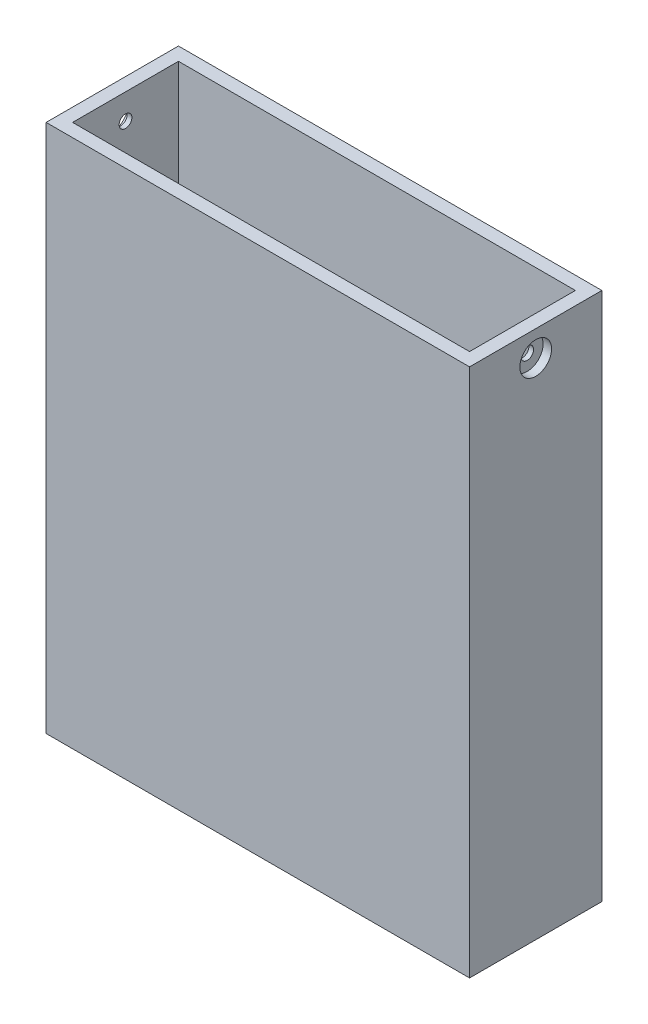
ISO-10303-21;
HEADER;
FILE_DESCRIPTION(('STEP AP214'),'2;1');
FILE_NAME('part.step','',(''),(''),'','','');
FILE_SCHEMA(('AUTOMOTIVE_DESIGN { 1 0 10303 214 1 1 1 1 }'));
ENDSEC;
DATA;
#1=APPLICATION_CONTEXT('core data for automotive mechanical design processes');
#2=APPLICATION_PROTOCOL_DEFINITION('international standard','automotive_design',2000,#1);
#3=PRODUCT_CONTEXT('',#1,'mechanical');
#4=PRODUCT('Part','Part','',(#3));
#5=PRODUCT_RELATED_PRODUCT_CATEGORY('part','',(#4));
#6=PRODUCT_DEFINITION_FORMATION('','',#4);
#7=PRODUCT_DEFINITION_CONTEXT('part definition',#1,'design');
#8=PRODUCT_DEFINITION('design','',#6,#7);
#9=PRODUCT_DEFINITION_SHAPE('','',#8);
#10=(LENGTH_UNIT() NAMED_UNIT(*) SI_UNIT(.MILLI.,.METRE.));
#11=(NAMED_UNIT(*) PLANE_ANGLE_UNIT() SI_UNIT($,.RADIAN.));
#12=(NAMED_UNIT(*) SI_UNIT($,.STERADIAN.) SOLID_ANGLE_UNIT());
#13=UNCERTAINTY_MEASURE_WITH_UNIT(LENGTH_MEASURE(1.E-05),#10,'distance_accuracy_value','');
#14=(GEOMETRIC_REPRESENTATION_CONTEXT(3) GLOBAL_UNCERTAINTY_ASSIGNED_CONTEXT((#13)) GLOBAL_UNIT_ASSIGNED_CONTEXT((#10,
#11,#12)) REPRESENTATION_CONTEXT('',''));
#15=CARTESIAN_POINT('',(0.,0.,0.));
#16=DIRECTION('',(0.,0.,1.));
#17=DIRECTION('',(1.,0.,0.));
#18=AXIS2_PLACEMENT_3D('',#15,#16,#17);
#19=CARTESIAN_POINT('',(-50.8,127.,15.875));
#20=DIRECTION('',(1.,0.,0.));
#21=DIRECTION('',(0.,0.,-1.));
#22=AXIS2_PLACEMENT_3D('',#19,#20,#21);
#23=PLANE('',#22);
#24=CARTESIAN_POINT('',(-50.8,120.904,0.));
#25=DIRECTION('',(-1.,0.,0.));
#26=DIRECTION('',(0.,0.,1.));
#27=AXIS2_PLACEMENT_3D('',#24,#25,#26);
#28=CIRCLE('',#27,3.80999999999999);
#29=CARTESIAN_POINT('',(-50.8,120.904,3.81000000000001));
#30=VERTEX_POINT('',#29);
#31=EDGE_CURVE('E190',#30,#30,#28,.T.);
#32=ORIENTED_EDGE('',*,*,#31,.F.);
#33=EDGE_LOOP('',(#32));
#34=FACE_BOUND('',#33,.T.);
#35=DIRECTION('',(0.,0.,1.));
#36=VECTOR('',#35,1.);
#37=CARTESIAN_POINT('',(-50.8,0.,15.875));
#38=LINE('',#37,#36);
#39=CARTESIAN_POINT('',(-50.8,0.,-15.875));
#40=VERTEX_POINT('',#39);
#41=CARTESIAN_POINT('',(-50.8,0.,15.875));
#42=VERTEX_POINT('',#41);
#43=EDGE_CURVE('E141',#40,#42,#38,.T.);
#44=ORIENTED_EDGE('',*,*,#43,.T.);
#45=DIRECTION('',(0.,-1.,0.));
#46=VECTOR('',#45,1.);
#47=CARTESIAN_POINT('',(-50.8,127.,15.875));
#48=LINE('',#47,#46);
#49=CARTESIAN_POINT('',(-50.8,127.,15.875));
#50=VERTEX_POINT('',#49);
#51=EDGE_CURVE('E12',#50,#42,#48,.T.);
#52=ORIENTED_EDGE('',*,*,#51,.F.);
#53=DIRECTION('',(0.,0.,1.));
#54=VECTOR('',#53,1.);
#55=CARTESIAN_POINT('',(-50.8,127.,15.875));
#56=LINE('',#55,#54);
#57=CARTESIAN_POINT('',(-50.8,127.,-15.875));
#58=VERTEX_POINT('',#57);
#59=EDGE_CURVE('E143',#58,#50,#56,.T.);
#60=ORIENTED_EDGE('',*,*,#59,.F.);
#61=DIRECTION('',(0.,-1.,0.));
#62=VECTOR('',#61,1.);
#63=CARTESIAN_POINT('',(-50.8,127.,-15.875));
#64=LINE('',#63,#62);
#65=EDGE_CURVE('E149',#58,#40,#64,.T.);
#66=ORIENTED_EDGE('',*,*,#65,.T.);
#67=EDGE_LOOP('',(#44,#52,#60,#66));
#68=FACE_BOUND('',#67,.T.);
#69=ADVANCED_FACE('F35',(#34,#68),#23,.F.);
#70=CARTESIAN_POINT('',(50.8,127.,15.875));
#71=DIRECTION('',(0.,0.,-1.));
#72=DIRECTION('',(-1.,0.,0.));
#73=AXIS2_PLACEMENT_3D('',#70,#71,#72);
#74=PLANE('',#73);
#75=DIRECTION('',(1.,0.,0.));
#76=VECTOR('',#75,1.);
#77=CARTESIAN_POINT('',(50.8,0.,15.875));
#78=LINE('',#77,#76);
#79=CARTESIAN_POINT('',(50.8,0.,15.875));
#80=VERTEX_POINT('',#79);
#81=EDGE_CURVE('E152',#42,#80,#78,.T.);
#82=ORIENTED_EDGE('',*,*,#81,.T.);
#83=DIRECTION('',(0.,-1.,0.));
#84=VECTOR('',#83,1.);
#85=CARTESIAN_POINT('',(50.8,127.,15.875));
#86=LINE('',#85,#84);
#87=CARTESIAN_POINT('',(50.8,127.,15.875));
#88=VERTEX_POINT('',#87);
#89=EDGE_CURVE('E42',#88,#80,#86,.T.);
#90=ORIENTED_EDGE('',*,*,#89,.F.);
#91=DIRECTION('',(1.,0.,0.));
#92=VECTOR('',#91,1.);
#93=CARTESIAN_POINT('',(50.8,127.,15.875));
#94=LINE('',#93,#92);
#95=EDGE_CURVE('E86',#50,#88,#94,.T.);
#96=ORIENTED_EDGE('',*,*,#95,.F.);
#97=ORIENTED_EDGE('',*,*,#51,.T.);
#98=EDGE_LOOP('',(#82,#90,#96,#97));
#99=FACE_BOUND('',#98,.T.);
#100=ADVANCED_FACE('F179',(#99),#74,.F.);
#101=CARTESIAN_POINT('',(50.8,127.,15.875));
#102=DIRECTION('',(-1.,0.,0.));
#103=DIRECTION('',(0.,0.,1.));
#104=AXIS2_PLACEMENT_3D('',#101,#102,#103);
#105=PLANE('',#104);
#106=CARTESIAN_POINT('',(50.8,120.904,0.));
#107=DIRECTION('',(1.,0.,0.));
#108=DIRECTION('',(0.,0.,-1.));
#109=AXIS2_PLACEMENT_3D('',#106,#107,#108);
#110=CIRCLE('',#109,3.80999999999999);
#111=CARTESIAN_POINT('',(50.8,120.904,-3.80999999999998));
#112=VERTEX_POINT('',#111);
#113=EDGE_CURVE('E348',#112,#112,#110,.T.);
#114=ORIENTED_EDGE('',*,*,#113,.F.);
#115=EDGE_LOOP('',(#114));
#116=FACE_BOUND('',#115,.T.);
#117=DIRECTION('',(0.,0.,-1.));
#118=VECTOR('',#117,1.);
#119=CARTESIAN_POINT('',(50.8,0.,15.875));
#120=LINE('',#119,#118);
#121=CARTESIAN_POINT('',(50.8,0.,-15.875));
#122=VERTEX_POINT('',#121);
#123=EDGE_CURVE('E154',#80,#122,#120,.T.);
#124=ORIENTED_EDGE('',*,*,#123,.T.);
#125=DIRECTION('',(0.,-1.,0.));
#126=VECTOR('',#125,1.);
#127=CARTESIAN_POINT('',(50.8,127.,-15.875));
#128=LINE('',#127,#126);
#129=CARTESIAN_POINT('',(50.8,127.,-15.875));
#130=VERTEX_POINT('',#129);
#131=EDGE_CURVE('E158',#130,#122,#128,.T.);
#132=ORIENTED_EDGE('',*,*,#131,.F.);
#133=DIRECTION('',(0.,0.,-1.));
#134=VECTOR('',#133,1.);
#135=CARTESIAN_POINT('',(50.8,127.,15.875));
#136=LINE('',#135,#134);
#137=EDGE_CURVE('E146',#88,#130,#136,.T.);
#138=ORIENTED_EDGE('',*,*,#137,.F.);
#139=ORIENTED_EDGE('',*,*,#89,.T.);
#140=EDGE_LOOP('',(#124,#132,#138,#139));
#141=FACE_BOUND('',#140,.T.);
#142=ADVANCED_FACE('F163',(#116,#141),#105,.F.);
#143=CARTESIAN_POINT('',(50.8,127.,-15.875));
#144=DIRECTION('',(0.,0.,1.));
#145=DIRECTION('',(1.,0.,0.));
#146=AXIS2_PLACEMENT_3D('',#143,#144,#145);
#147=PLANE('',#146);
#148=DIRECTION('',(-1.,0.,0.));
#149=VECTOR('',#148,1.);
#150=CARTESIAN_POINT('',(50.8,0.,-15.875));
#151=LINE('',#150,#149);
#152=EDGE_CURVE('E79',#122,#40,#151,.T.);
#153=ORIENTED_EDGE('',*,*,#152,.T.);
#154=ORIENTED_EDGE('',*,*,#65,.F.);
#155=DIRECTION('',(-1.,0.,0.));
#156=VECTOR('',#155,1.);
#157=CARTESIAN_POINT('',(50.8,127.,-15.875));
#158=LINE('',#157,#156);
#159=EDGE_CURVE('E58',#130,#58,#158,.T.);
#160=ORIENTED_EDGE('',*,*,#159,.F.);
#161=ORIENTED_EDGE('',*,*,#131,.T.);
#162=EDGE_LOOP('',(#153,#154,#160,#161));
#163=FACE_BOUND('',#162,.T.);
#164=ADVANCED_FACE('F171',(#163),#147,.F.);
#165=CARTESIAN_POINT('',(0.,127.,0.));
#166=DIRECTION('',(0.,1.,0.));
#167=DIRECTION('',(0.,0.,1.));
#168=AXIS2_PLACEMENT_3D('',#165,#166,#167);
#169=PLANE('',#168);
#170=DIRECTION('',(-1.,0.,0.));
#171=VECTOR('',#170,1.);
#172=CARTESIAN_POINT('',(47.625,127.,-12.7));
#173=LINE('',#172,#171);
#174=CARTESIAN_POINT('',(47.625,127.,-12.7));
#175=VERTEX_POINT('',#174);
#176=CARTESIAN_POINT('',(-47.625,127.,-12.7));
#177=VERTEX_POINT('',#176);
#178=EDGE_CURVE('E49',#175,#177,#173,.T.);
#179=ORIENTED_EDGE('',*,*,#178,.F.);
#180=DIRECTION('',(0.,0.,-1.));
#181=VECTOR('',#180,1.);
#182=CARTESIAN_POINT('',(47.625,127.,12.7));
#183=LINE('',#182,#181);
#184=CARTESIAN_POINT('',(47.625,127.,12.7));
#185=VERTEX_POINT('',#184);
#186=EDGE_CURVE('E130',#185,#175,#183,.T.);
#187=ORIENTED_EDGE('',*,*,#186,.F.);
#188=DIRECTION('',(1.,0.,0.));
#189=VECTOR('',#188,1.);
#190=CARTESIAN_POINT('',(-47.625,127.,12.7));
#191=LINE('',#190,#189);
#192=CARTESIAN_POINT('',(-47.625,127.,12.7));
#193=VERTEX_POINT('',#192);
#194=EDGE_CURVE('E114',#193,#185,#191,.T.);
#195=ORIENTED_EDGE('',*,*,#194,.F.);
#196=DIRECTION('',(0.,0.,1.));
#197=VECTOR('',#196,1.);
#198=CARTESIAN_POINT('',(-47.625,127.,-12.7));
#199=LINE('',#198,#197);
#200=EDGE_CURVE('E124',#177,#193,#199,.T.);
#201=ORIENTED_EDGE('',*,*,#200,.F.);
#202=EDGE_LOOP('',(#179,#187,#195,#201));
#203=FACE_BOUND('',#202,.T.);
#204=ORIENTED_EDGE('',*,*,#59,.T.);
#205=ORIENTED_EDGE('',*,*,#95,.T.);
#206=ORIENTED_EDGE('',*,*,#137,.T.);
#207=ORIENTED_EDGE('',*,*,#159,.T.);
#208=EDGE_LOOP('',(#204,#205,#206,#207));
#209=FACE_BOUND('',#208,.T.);
#210=ADVANCED_FACE('F128',(#203,#209),#169,.T.);
#211=CARTESIAN_POINT('',(0.,0.,0.));
#212=DIRECTION('',(0.,1.,0.));
#213=DIRECTION('',(0.,0.,1.));
#214=AXIS2_PLACEMENT_3D('',#211,#212,#213);
#215=PLANE('',#214);
#216=ORIENTED_EDGE('',*,*,#43,.F.);
#217=ORIENTED_EDGE('',*,*,#152,.F.);
#218=ORIENTED_EDGE('',*,*,#123,.F.);
#219=ORIENTED_EDGE('',*,*,#81,.F.);
#220=EDGE_LOOP('',(#216,#217,#218,#219));
#221=FACE_BOUND('',#220,.T.);
#222=ADVANCED_FACE('F167',(#221),#215,.F.);
#223=CARTESIAN_POINT('',(47.625,-98.5785093212512,-12.7));
#224=DIRECTION('',(0.,0.,-1.));
#225=DIRECTION('',(-1.,0.,0.));
#226=AXIS2_PLACEMENT_3D('',#223,#224,#225);
#227=PLANE('',#226);
#228=DIRECTION('',(1.,0.,0.));
#229=VECTOR('',#228,1.);
#230=CARTESIAN_POINT('',(47.625,3.175,-12.7));
#231=LINE('',#230,#229);
#232=CARTESIAN_POINT('',(-47.625,3.175,-12.7));
#233=VERTEX_POINT('',#232);
#234=CARTESIAN_POINT('',(47.625,3.175,-12.7));
#235=VERTEX_POINT('',#234);
#236=EDGE_CURVE('E142',#233,#235,#231,.T.);
#237=ORIENTED_EDGE('',*,*,#236,.T.);
#238=DIRECTION('',(0.,1.,0.));
#239=VECTOR('',#238,1.);
#240=CARTESIAN_POINT('',(47.625,-98.5785093212512,-12.7));
#241=LINE('',#240,#239);
#242=EDGE_CURVE('E135',#235,#175,#241,.T.);
#243=ORIENTED_EDGE('',*,*,#242,.T.);
#244=ORIENTED_EDGE('',*,*,#178,.T.);
#245=DIRECTION('',(0.,1.,0.));
#246=VECTOR('',#245,1.);
#247=CARTESIAN_POINT('',(-47.625,-98.5785093212512,-12.7));
#248=LINE('',#247,#246);
#249=EDGE_CURVE('E121',#233,#177,#248,.T.);
#250=ORIENTED_EDGE('',*,*,#249,.F.);
#251=EDGE_LOOP('',(#237,#243,#244,#250));
#252=FACE_BOUND('',#251,.T.);
#253=ADVANCED_FACE('F213',(#252),#227,.F.);
#254=CARTESIAN_POINT('',(47.625,-98.5785093212512,12.7));
#255=DIRECTION('',(1.,0.,0.));
#256=DIRECTION('',(0.,0.,-1.));
#257=AXIS2_PLACEMENT_3D('',#254,#255,#256);
#258=PLANE('',#257);
#259=CARTESIAN_POINT('',(47.625,120.904,0.));
#260=DIRECTION('',(1.,0.,0.));
#261=DIRECTION('',(0.,0.,-1.));
#262=AXIS2_PLACEMENT_3D('',#259,#260,#261);
#263=CIRCLE('',#262,1.524);
#264=CARTESIAN_POINT('',(47.625,120.904,-1.52399999999999));
#265=VERTEX_POINT('',#264);
#266=EDGE_CURVE('E193',#265,#265,#263,.T.);
#267=ORIENTED_EDGE('',*,*,#266,.T.);
#268=EDGE_LOOP('',(#267));
#269=FACE_BOUND('',#268,.T.);
#270=DIRECTION('',(0.,0.,1.));
#271=VECTOR('',#270,1.);
#272=CARTESIAN_POINT('',(47.625,3.175,12.7));
#273=LINE('',#272,#271);
#274=CARTESIAN_POINT('',(47.625,3.175,12.7));
#275=VERTEX_POINT('',#274);
#276=EDGE_CURVE('E209',#235,#275,#273,.T.);
#277=ORIENTED_EDGE('',*,*,#276,.T.);
#278=DIRECTION('',(0.,1.,0.));
#279=VECTOR('',#278,1.);
#280=CARTESIAN_POINT('',(47.625,-98.5785093212512,12.7));
#281=LINE('',#280,#279);
#282=EDGE_CURVE('E120',#275,#185,#281,.T.);
#283=ORIENTED_EDGE('',*,*,#282,.T.);
#284=ORIENTED_EDGE('',*,*,#186,.T.);
#285=ORIENTED_EDGE('',*,*,#242,.F.);
#286=EDGE_LOOP('',(#277,#283,#284,#285));
#287=FACE_BOUND('',#286,.T.);
#288=ADVANCED_FACE('F218',(#269,#287),#258,.F.);
#289=CARTESIAN_POINT('',(-47.625,-98.5785093212512,12.7));
#290=DIRECTION('',(0.,0.,1.));
#291=DIRECTION('',(1.,0.,0.));
#292=AXIS2_PLACEMENT_3D('',#289,#290,#291);
#293=PLANE('',#292);
#294=DIRECTION('',(-1.,0.,0.));
#295=VECTOR('',#294,1.);
#296=CARTESIAN_POINT('',(-47.625,3.175,12.7));
#297=LINE('',#296,#295);
#298=CARTESIAN_POINT('',(-47.625,3.175,12.7));
#299=VERTEX_POINT('',#298);
#300=EDGE_CURVE('E117',#275,#299,#297,.T.);
#301=ORIENTED_EDGE('',*,*,#300,.T.);
#302=DIRECTION('',(0.,1.,0.));
#303=VECTOR('',#302,1.);
#304=CARTESIAN_POINT('',(-47.625,-98.5785093212512,12.7));
#305=LINE('',#304,#303);
#306=EDGE_CURVE('E109',#299,#193,#305,.T.);
#307=ORIENTED_EDGE('',*,*,#306,.T.);
#308=ORIENTED_EDGE('',*,*,#194,.T.);
#309=ORIENTED_EDGE('',*,*,#282,.F.);
#310=EDGE_LOOP('',(#301,#307,#308,#309));
#311=FACE_BOUND('',#310,.T.);
#312=ADVANCED_FACE('F111',(#311),#293,.F.);
#313=CARTESIAN_POINT('',(-47.625,-98.5785093212512,-12.7));
#314=DIRECTION('',(-1.,0.,0.));
#315=DIRECTION('',(0.,0.,1.));
#316=AXIS2_PLACEMENT_3D('',#313,#314,#315);
#317=PLANE('',#316);
#318=CARTESIAN_POINT('',(-47.625,120.904,0.));
#319=DIRECTION('',(-1.,0.,0.));
#320=DIRECTION('',(0.,0.,1.));
#321=AXIS2_PLACEMENT_3D('',#318,#319,#320);
#322=CIRCLE('',#321,1.52400000000001);
#323=CARTESIAN_POINT('',(-47.625,120.904,1.52400000000003));
#324=VERTEX_POINT('',#323);
#325=EDGE_CURVE('E205',#324,#324,#322,.T.);
#326=ORIENTED_EDGE('',*,*,#325,.T.);
#327=EDGE_LOOP('',(#326));
#328=FACE_BOUND('',#327,.T.);
#329=DIRECTION('',(0.,0.,-1.));
#330=VECTOR('',#329,1.);
#331=CARTESIAN_POINT('',(-47.625,3.175,-12.7));
#332=LINE('',#331,#330);
#333=EDGE_CURVE('E139',#299,#233,#332,.T.);
#334=ORIENTED_EDGE('',*,*,#333,.T.);
#335=ORIENTED_EDGE('',*,*,#249,.T.);
#336=ORIENTED_EDGE('',*,*,#200,.T.);
#337=ORIENTED_EDGE('',*,*,#306,.F.);
#338=EDGE_LOOP('',(#334,#335,#336,#337));
#339=FACE_BOUND('',#338,.T.);
#340=ADVANCED_FACE('F125',(#328,#339),#317,.F.);
#341=CARTESIAN_POINT('',(0.,3.175,0.));
#342=DIRECTION('',(0.,1.,0.));
#343=DIRECTION('',(0.,0.,1.));
#344=AXIS2_PLACEMENT_3D('',#341,#342,#343);
#345=PLANE('',#344);
#346=ORIENTED_EDGE('',*,*,#236,.F.);
#347=ORIENTED_EDGE('',*,*,#333,.F.);
#348=ORIENTED_EDGE('',*,*,#300,.F.);
#349=ORIENTED_EDGE('',*,*,#276,.F.);
#350=EDGE_LOOP('',(#346,#347,#348,#349));
#351=FACE_BOUND('',#350,.T.);
#352=ADVANCED_FACE('F216',(#351),#345,.T.);
#353=CARTESIAN_POINT('',(-50.8,120.904,0.));
#354=DIRECTION('',(-1.,0.,0.));
#355=DIRECTION('',(0.,0.,1.));
#356=AXIS2_PLACEMENT_3D('',#353,#354,#355);
#357=CYLINDRICAL_SURFACE('',#356,1.52400000000001);
#358=ORIENTED_EDGE('',*,*,#325,.F.);
#359=EDGE_LOOP('',(#358));
#360=FACE_BOUND('',#359,.T.);
#361=CARTESIAN_POINT('',(-48.768,120.904,0.));
#362=DIRECTION('',(-1.,0.,0.));
#363=DIRECTION('',(0.,0.,1.));
#364=AXIS2_PLACEMENT_3D('',#361,#362,#363);
#365=CIRCLE('',#364,1.52400000000001);
#366=CARTESIAN_POINT('',(-48.768,120.904,1.52400000000003));
#367=VERTEX_POINT('',#366);
#368=EDGE_CURVE('E196',#367,#367,#365,.T.);
#369=ORIENTED_EDGE('',*,*,#368,.T.);
#370=EDGE_LOOP('',(#369));
#371=FACE_BOUND('',#370,.T.);
#372=ADVANCED_FACE('F260',(#360,#371),#357,.F.);
#373=CARTESIAN_POINT('',(-48.768,122.428,0.));
#374=DIRECTION('',(1.,0.,0.));
#375=DIRECTION('',(0.,0.,-1.));
#376=AXIS2_PLACEMENT_3D('',#373,#374,#375);
#377=PLANE('',#376);
#378=ORIENTED_EDGE('',*,*,#368,.F.);
#379=EDGE_LOOP('',(#378));
#380=FACE_BOUND('',#379,.T.);
#381=CARTESIAN_POINT('',(-48.768,120.904,0.));
#382=DIRECTION('',(-1.,0.,0.));
#383=DIRECTION('',(0.,0.,1.));
#384=AXIS2_PLACEMENT_3D('',#381,#382,#383);
#385=CIRCLE('',#384,3.80999999999999);
#386=CARTESIAN_POINT('',(-48.768,120.904,3.81000000000001));
#387=VERTEX_POINT('',#386);
#388=EDGE_CURVE('E192',#387,#387,#385,.T.);
#389=ORIENTED_EDGE('',*,*,#388,.T.);
#390=EDGE_LOOP('',(#389));
#391=FACE_BOUND('',#390,.T.);
#392=ADVANCED_FACE('F279',(#380,#391),#377,.F.);
#393=CARTESIAN_POINT('',(-50.8,120.904,0.));
#394=DIRECTION('',(-1.,0.,0.));
#395=DIRECTION('',(0.,0.,1.));
#396=AXIS2_PLACEMENT_3D('',#393,#394,#395);
#397=CYLINDRICAL_SURFACE('',#396,3.80999999999999);
#398=ORIENTED_EDGE('',*,*,#388,.F.);
#399=EDGE_LOOP('',(#398));
#400=FACE_BOUND('',#399,.T.);
#401=ORIENTED_EDGE('',*,*,#31,.T.);
#402=EDGE_LOOP('',(#401));
#403=FACE_BOUND('',#402,.T.);
#404=ADVANCED_FACE('F288',(#400,#403),#397,.F.);
#405=CARTESIAN_POINT('',(50.8,120.904,0.));
#406=DIRECTION('',(1.,0.,0.));
#407=DIRECTION('',(0.,0.,-1.));
#408=AXIS2_PLACEMENT_3D('',#405,#406,#407);
#409=CYLINDRICAL_SURFACE('',#408,1.524);
#410=ORIENTED_EDGE('',*,*,#266,.F.);
#411=EDGE_LOOP('',(#410));
#412=FACE_BOUND('',#411,.T.);
#413=CARTESIAN_POINT('',(48.768,120.904,0.));
#414=DIRECTION('',(1.,0.,0.));
#415=DIRECTION('',(0.,0.,-1.));
#416=AXIS2_PLACEMENT_3D('',#413,#414,#415);
#417=CIRCLE('',#416,1.52400000000001);
#418=CARTESIAN_POINT('',(48.768,120.904,-1.524));
#419=VERTEX_POINT('',#418);
#420=EDGE_CURVE('E199',#419,#419,#417,.T.);
#421=ORIENTED_EDGE('',*,*,#420,.T.);
#422=EDGE_LOOP('',(#421));
#423=FACE_BOUND('',#422,.T.);
#424=ADVANCED_FACE('F298',(#412,#423),#409,.F.);
#425=CARTESIAN_POINT('',(48.768,122.428,0.));
#426=DIRECTION('',(-1.,0.,0.));
#427=DIRECTION('',(0.,0.,1.));
#428=AXIS2_PLACEMENT_3D('',#425,#426,#427);
#429=PLANE('',#428);
#430=ORIENTED_EDGE('',*,*,#420,.F.);
#431=EDGE_LOOP('',(#430));
#432=FACE_BOUND('',#431,.T.);
#433=CARTESIAN_POINT('',(48.768,120.904,0.));
#434=DIRECTION('',(1.,0.,0.));
#435=DIRECTION('',(0.,0.,-1.));
#436=AXIS2_PLACEMENT_3D('',#433,#434,#435);
#437=CIRCLE('',#436,3.80999999999999);
#438=CARTESIAN_POINT('',(48.768,120.904,-3.80999999999998));
#439=VERTEX_POINT('',#438);
#440=EDGE_CURVE('E345',#439,#439,#437,.T.);
#441=ORIENTED_EDGE('',*,*,#440,.T.);
#442=EDGE_LOOP('',(#441));
#443=FACE_BOUND('',#442,.T.);
#444=ADVANCED_FACE('F318',(#432,#443),#429,.F.);
#445=CARTESIAN_POINT('',(50.8,120.904,0.));
#446=DIRECTION('',(1.,0.,0.));
#447=DIRECTION('',(0.,0.,-1.));
#448=AXIS2_PLACEMENT_3D('',#445,#446,#447);
#449=CYLINDRICAL_SURFACE('',#448,3.80999999999999);
#450=ORIENTED_EDGE('',*,*,#440,.F.);
#451=EDGE_LOOP('',(#450));
#452=FACE_BOUND('',#451,.T.);
#453=ORIENTED_EDGE('',*,*,#113,.T.);
#454=EDGE_LOOP('',(#453));
#455=FACE_BOUND('',#454,.T.);
#456=ADVANCED_FACE('F328',(#452,#455),#449,.F.);
#457=CLOSED_SHELL('',(#69,#100,#142,#164,#210,#222,#253,#288,#312,#340,#352,#372,#392,#404,#424,
#444,#456));
#458=MANIFOLD_SOLID_BREP('B2',#457);
#459=ADVANCED_BREP_SHAPE_REPRESENTATION('',(#18,#458),#14);
#460=SHAPE_DEFINITION_REPRESENTATION(#9,#459);
ENDSEC;
END-ISO-10303-21;
